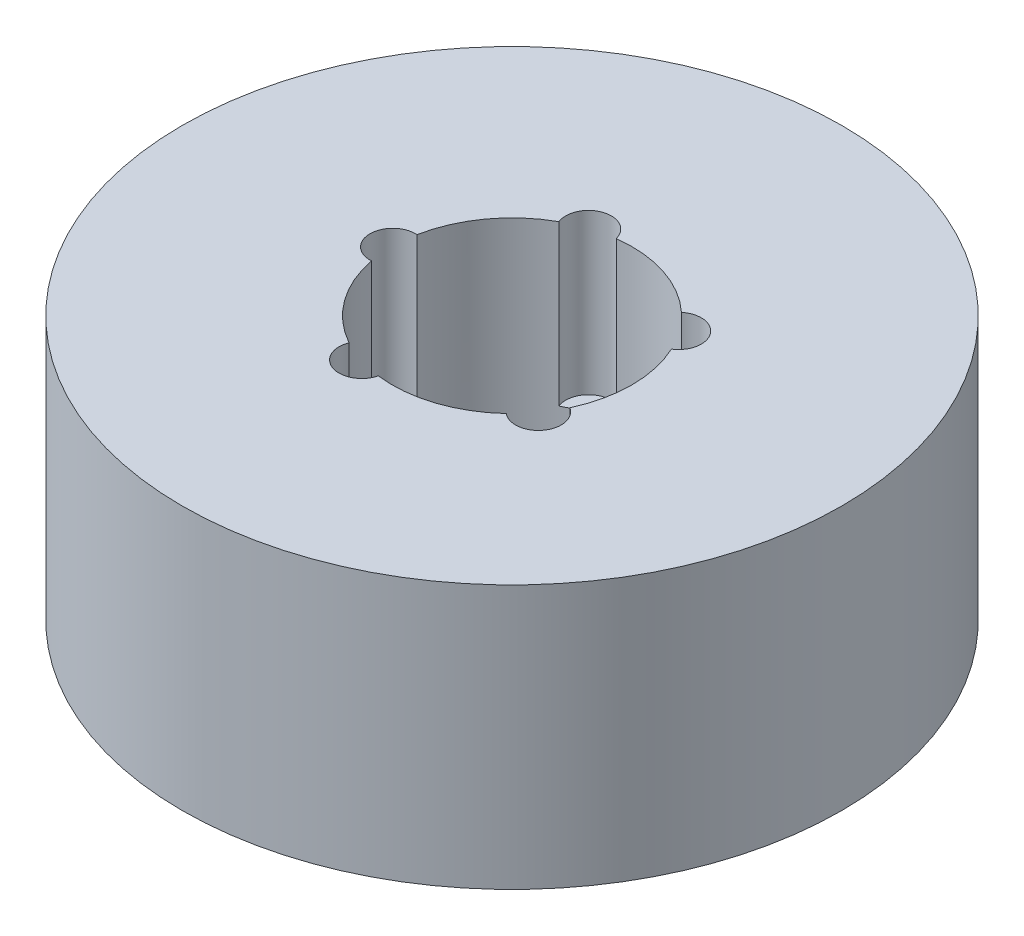
ISO-10303-21;
HEADER;
FILE_DESCRIPTION(('STEP AP214'),'2;1');
FILE_NAME('part.step','',(''),(''),'','','');
FILE_SCHEMA(('AUTOMOTIVE_DESIGN { 1 0 10303 214 1 1 1 1 }'));
ENDSEC;
DATA;
#1=APPLICATION_CONTEXT('core data for automotive mechanical design processes');
#2=APPLICATION_PROTOCOL_DEFINITION('international standard','automotive_design',2000,#1);
#3=PRODUCT_CONTEXT('',#1,'mechanical');
#4=PRODUCT('Part','Part','',(#3));
#5=PRODUCT_RELATED_PRODUCT_CATEGORY('part','',(#4));
#6=PRODUCT_DEFINITION_FORMATION('','',#4);
#7=PRODUCT_DEFINITION_CONTEXT('part definition',#1,'design');
#8=PRODUCT_DEFINITION('design','',#6,#7);
#9=PRODUCT_DEFINITION_SHAPE('','',#8);
#10=(LENGTH_UNIT() NAMED_UNIT(*) SI_UNIT(.MILLI.,.METRE.));
#11=(NAMED_UNIT(*) PLANE_ANGLE_UNIT() SI_UNIT($,.RADIAN.));
#12=(NAMED_UNIT(*) SI_UNIT($,.STERADIAN.) SOLID_ANGLE_UNIT());
#13=UNCERTAINTY_MEASURE_WITH_UNIT(LENGTH_MEASURE(1.E-05),#10,'distance_accuracy_value','');
#14=(GEOMETRIC_REPRESENTATION_CONTEXT(3) GLOBAL_UNCERTAINTY_ASSIGNED_CONTEXT((#13)) GLOBAL_UNIT_ASSIGNED_CONTEXT((#10,
#11,#12)) REPRESENTATION_CONTEXT('',''));
#15=CARTESIAN_POINT('',(0.,0.,0.));
#16=DIRECTION('',(0.,0.,1.));
#17=DIRECTION('',(1.,0.,0.));
#18=AXIS2_PLACEMENT_3D('',#15,#16,#17);
#19=CARTESIAN_POINT('',(0.,22.,0.));
#20=DIRECTION('',(0.,-1.,0.));
#21=DIRECTION('',(0.,0.,-1.));
#22=AXIS2_PLACEMENT_3D('',#19,#20,#21);
#23=CYLINDRICAL_SURFACE('',#22,27.5);
#24=CARTESIAN_POINT('',(0.,22.,0.));
#25=DIRECTION('',(0.,1.,0.));
#26=DIRECTION('',(0.,0.,1.));
#27=AXIS2_PLACEMENT_3D('',#24,#25,#26);
#28=CIRCLE('',#27,27.5);
#29=CARTESIAN_POINT('',(0.,22.,27.5));
#30=VERTEX_POINT('',#29);
#31=EDGE_CURVE('E157',#30,#30,#28,.T.);
#32=ORIENTED_EDGE('',*,*,#31,.F.);
#33=EDGE_LOOP('',(#32));
#34=FACE_BOUND('',#33,.T.);
#35=CARTESIAN_POINT('',(0.,0.,0.));
#36=DIRECTION('',(0.,1.,0.));
#37=DIRECTION('',(0.,0.,1.));
#38=AXIS2_PLACEMENT_3D('',#35,#36,#37);
#39=CIRCLE('',#38,27.5);
#40=CARTESIAN_POINT('',(0.,0.,27.5));
#41=VERTEX_POINT('',#40);
#42=EDGE_CURVE('E150',#41,#41,#39,.T.);
#43=ORIENTED_EDGE('',*,*,#42,.T.);
#44=EDGE_LOOP('',(#43));
#45=FACE_BOUND('',#44,.T.);
#46=ADVANCED_FACE('F39',(#34,#45),#23,.T.);
#47=CARTESIAN_POINT('',(0.,22.,0.));
#48=DIRECTION('',(0.,1.,0.));
#49=DIRECTION('',(0.,0.,1.));
#50=AXIS2_PLACEMENT_3D('',#47,#48,#49);
#51=PLANE('',#50);
#52=CARTESIAN_POINT('',(-3.07249362484301,22.,-9.45616304725487));
#53=DIRECTION('',(0.,1.,0.));
#54=DIRECTION('',(-0.95105651629515,0.,0.309016994374958));
#55=AXIS2_PLACEMENT_3D('',#52,#53,#54);
#56=CIRCLE('',#55,1.90239745731445);
#57=CARTESIAN_POINT('',(-1.22857995740503,22.,-9.92424260527032));
#58=VERTEX_POINT('',#57);
#59=CARTESIAN_POINT('',(-4.8393813790616,22.,-8.75102210418828));
#60=VERTEX_POINT('',#59);
#61=EDGE_CURVE('E194',#58,#60,#56,.T.);
#62=ORIENTED_EDGE('',*,*,#61,.F.);
#63=CARTESIAN_POINT('',(0.,22.,0.));
#64=DIRECTION('',(0.,1.,0.));
#65=DIRECTION('',(0.,0.,1.));
#66=AXIS2_PLACEMENT_3D('',#63,#64,#65);
#67=CIRCLE('',#66,10.);
#68=CARTESIAN_POINT('',(6.8272655080395,22.,-7.30673974373894));
#69=VERTEX_POINT('',#68);
#70=EDGE_CURVE('E147',#69,#58,#67,.T.);
#71=ORIENTED_EDGE('',*,*,#70,.F.);
#72=CARTESIAN_POINT('',(8.04389274005602,22.,-5.84423016636438));
#73=DIRECTION('',(0.,1.,0.));
#74=DIRECTION('',(-0.58778525229248,0.,-0.809016994374942));
#75=AXIS2_PLACEMENT_3D('',#72,#73,#74);
#76=CIRCLE('',#75,1.90239745731445);
#77=CARTESIAN_POINT('',(9.05886351324974,22.,-4.23520859560809));
#78=VERTEX_POINT('',#77);
#79=EDGE_CURVE('E254',#78,#69,#76,.T.);
#80=ORIENTED_EDGE('',*,*,#79,.F.);
#81=CARTESIAN_POINT('',(9.0588635132498,22.,4.23520859560796));
#82=VERTEX_POINT('',#81);
#83=EDGE_CURVE('E144',#82,#78,#67,.T.);
#84=ORIENTED_EDGE('',*,*,#83,.F.);
#85=CARTESIAN_POINT('',(8.04389274005611,22.,5.84423016636427));
#86=DIRECTION('',(0.,1.,0.));
#87=DIRECTION('',(0.587785252292469,0.,-0.809016994374951));
#88=AXIS2_PLACEMENT_3D('',#85,#86,#87);
#89=CIRCLE('',#88,1.90239745731445);
#90=CARTESIAN_POINT('',(6.8272655080396,22.,7.30673974373884));
#91=VERTEX_POINT('',#90);
#92=EDGE_CURVE('E141',#91,#82,#89,.T.);
#93=ORIENTED_EDGE('',*,*,#92,.F.);
#94=CARTESIAN_POINT('',(-1.22857995740489,22.,9.92424260527034));
#95=VERTEX_POINT('',#94);
#96=EDGE_CURVE('E134',#95,#91,#67,.T.);
#97=ORIENTED_EDGE('',*,*,#96,.F.);
#98=CARTESIAN_POINT('',(-3.07249362484287,22.,9.45616304725492));
#99=DIRECTION('',(0.,1.,0.));
#100=DIRECTION('',(0.951056516295155,0.,0.309016994374945));
#101=AXIS2_PLACEMENT_3D('',#98,#99,#100);
#102=CIRCLE('',#101,1.90239745731445);
#103=CARTESIAN_POINT('',(-4.83938137906148,22.,8.75102210418834));
#104=VERTEX_POINT('',#103);
#105=EDGE_CURVE('E111',#104,#95,#102,.T.);
#106=ORIENTED_EDGE('',*,*,#105,.F.);
#107=CARTESIAN_POINT('',(-9.81816768482291,22.,1.89831064704886));
#108=VERTEX_POINT('',#107);
#109=EDGE_CURVE('E145',#108,#104,#67,.T.);
#110=ORIENTED_EDGE('',*,*,#109,.F.);
#111=CARTESIAN_POINT('',(-9.94279823042636,22.,0.));
#112=DIRECTION('',(0.,1.,0.));
#113=DIRECTION('',(0.,0.,1.));
#114=AXIS2_PLACEMENT_3D('',#111,#112,#113);
#115=CIRCLE('',#114,1.90239745731445);
#116=CARTESIAN_POINT('',(-9.81816768482291,22.,-1.89831064704886));
#117=VERTEX_POINT('',#116);
#118=EDGE_CURVE('E153',#117,#108,#115,.T.);
#119=ORIENTED_EDGE('',*,*,#118,.F.);
#120=EDGE_CURVE('E146',#60,#117,#67,.T.);
#121=ORIENTED_EDGE('',*,*,#120,.F.);
#122=EDGE_LOOP('',(#62,#71,#80,#84,#93,#97,#106,#110,#119,#121));
#123=FACE_BOUND('',#122,.T.);
#124=ORIENTED_EDGE('',*,*,#31,.T.);
#125=EDGE_LOOP('',(#124));
#126=FACE_BOUND('',#125,.T.);
#127=ADVANCED_FACE('F139',(#123,#126),#51,.T.);
#128=CARTESIAN_POINT('',(0.,0.,0.));
#129=DIRECTION('',(0.,1.,0.));
#130=DIRECTION('',(0.,0.,1.));
#131=AXIS2_PLACEMENT_3D('',#128,#129,#130);
#132=PLANE('',#131);
#133=CARTESIAN_POINT('',(0.,0.,0.));
#134=DIRECTION('',(0.,1.,0.));
#135=DIRECTION('',(0.,0.,1.));
#136=AXIS2_PLACEMENT_3D('',#133,#134,#135);
#137=CIRCLE('',#136,10.);
#138=CARTESIAN_POINT('',(0.,0.,10.));
#139=VERTEX_POINT('',#138);
#140=EDGE_CURVE('E154',#139,#139,#137,.T.);
#141=ORIENTED_EDGE('',*,*,#140,.T.);
#142=EDGE_LOOP('',(#141));
#143=FACE_BOUND('',#142,.T.);
#144=ORIENTED_EDGE('',*,*,#42,.F.);
#145=EDGE_LOOP('',(#144));
#146=FACE_BOUND('',#145,.T.);
#147=ADVANCED_FACE('F213',(#143,#146),#132,.F.);
#148=CARTESIAN_POINT('',(0.,22.,0.));
#149=DIRECTION('',(0.,-1.,0.));
#150=DIRECTION('',(0.,0.,-1.));
#151=AXIS2_PLACEMENT_3D('',#148,#149,#150);
#152=CYLINDRICAL_SURFACE('',#151,10.);
#153=DIRECTION('',(0.,1.,0.));
#154=VECTOR('',#153,1.);
#155=CARTESIAN_POINT('',(-1.22857995740503,15.3415451495492,-9.92424260527032));
#156=LINE('',#155,#154);
#157=CARTESIAN_POINT('',(-1.22857995740503,8.68309029909848,-9.92424260527032));
#158=VERTEX_POINT('',#157);
#159=EDGE_CURVE('E11',#158,#58,#156,.T.);
#160=ORIENTED_EDGE('',*,*,#159,.F.);
#161=CARTESIAN_POINT('',(0.,8.68309029909848,0.));
#162=DIRECTION('',(0.,1.,0.));
#163=DIRECTION('',(0.,0.,1.));
#164=AXIS2_PLACEMENT_3D('',#161,#162,#163);
#165=CIRCLE('',#164,10.);
#166=CARTESIAN_POINT('',(-4.8393813790616,8.68309029909848,-8.75102210418828));
#167=VERTEX_POINT('',#166);
#168=EDGE_CURVE('E189',#158,#167,#165,.T.);
#169=ORIENTED_EDGE('',*,*,#168,.T.);
#170=DIRECTION('',(0.,1.,0.));
#171=VECTOR('',#170,1.);
#172=CARTESIAN_POINT('',(-4.8393813790616,15.3415451495492,-8.75102210418827));
#173=LINE('',#172,#171);
#174=EDGE_CURVE('E46',#60,#167,#173,.F.);
#175=ORIENTED_EDGE('',*,*,#174,.F.);
#176=ORIENTED_EDGE('',*,*,#120,.T.);
#177=DIRECTION('',(0.,1.,0.));
#178=VECTOR('',#177,1.);
#179=CARTESIAN_POINT('',(-9.81816768482291,15.3415451495492,-1.89831064704886));
#180=LINE('',#179,#178);
#181=CARTESIAN_POINT('',(-9.81816768482291,8.68309029909848,-1.89831064704886));
#182=VERTEX_POINT('',#181);
#183=EDGE_CURVE('E168',#182,#117,#180,.T.);
#184=ORIENTED_EDGE('',*,*,#183,.F.);
#185=CARTESIAN_POINT('',(0.,8.68309029909848,0.));
#186=DIRECTION('',(0.,1.,0.));
#187=DIRECTION('',(0.,0.,1.));
#188=AXIS2_PLACEMENT_3D('',#185,#186,#187);
#189=CIRCLE('',#188,10.);
#190=CARTESIAN_POINT('',(-9.81816768482291,8.68309029909848,1.89831064704886));
#191=VERTEX_POINT('',#190);
#192=EDGE_CURVE('E165',#182,#191,#189,.T.);
#193=ORIENTED_EDGE('',*,*,#192,.T.);
#194=DIRECTION('',(0.,1.,0.));
#195=VECTOR('',#194,1.);
#196=CARTESIAN_POINT('',(-9.81816768482291,15.3415451495492,1.89831064704886));
#197=LINE('',#196,#195);
#198=EDGE_CURVE('E170',#108,#191,#197,.F.);
#199=ORIENTED_EDGE('',*,*,#198,.F.);
#200=ORIENTED_EDGE('',*,*,#109,.T.);
#201=DIRECTION('',(0.,1.,0.));
#202=VECTOR('',#201,1.);
#203=CARTESIAN_POINT('',(-4.83938137906148,15.3415451495492,8.75102210418835));
#204=LINE('',#203,#202);
#205=CARTESIAN_POINT('',(-4.83938137906148,8.68309029909848,8.75102210418834));
#206=VERTEX_POINT('',#205);
#207=EDGE_CURVE('E121',#206,#104,#204,.T.);
#208=ORIENTED_EDGE('',*,*,#207,.F.);
#209=CARTESIAN_POINT('',(0.,8.68309029909848,0.));
#210=DIRECTION('',(0.,1.,0.));
#211=DIRECTION('',(0.,0.,1.));
#212=AXIS2_PLACEMENT_3D('',#209,#210,#211);
#213=CIRCLE('',#212,10.);
#214=CARTESIAN_POINT('',(-1.22857995740489,8.68309029909848,9.92424260527034));
#215=VERTEX_POINT('',#214);
#216=EDGE_CURVE('E136',#206,#215,#213,.T.);
#217=ORIENTED_EDGE('',*,*,#216,.T.);
#218=DIRECTION('',(0.,1.,0.));
#219=VECTOR('',#218,1.);
#220=CARTESIAN_POINT('',(-1.22857995740489,15.3415451495492,9.92424260527034));
#221=LINE('',#220,#219);
#222=EDGE_CURVE('E117',#95,#215,#221,.F.);
#223=ORIENTED_EDGE('',*,*,#222,.F.);
#224=ORIENTED_EDGE('',*,*,#96,.T.);
#225=DIRECTION('',(0.,1.,0.));
#226=VECTOR('',#225,1.);
#227=CARTESIAN_POINT('',(6.8272655080396,15.3415451495492,7.30673974373884));
#228=LINE('',#227,#226);
#229=CARTESIAN_POINT('',(6.8272655080396,8.68309029909848,7.30673974373884));
#230=VERTEX_POINT('',#229);
#231=EDGE_CURVE('E182',#230,#91,#228,.T.);
#232=ORIENTED_EDGE('',*,*,#231,.F.);
#233=CARTESIAN_POINT('',(0.,8.68309029909848,0.));
#234=DIRECTION('',(0.,1.,0.));
#235=DIRECTION('',(0.,0.,1.));
#236=AXIS2_PLACEMENT_3D('',#233,#234,#235);
#237=CIRCLE('',#236,10.);
#238=CARTESIAN_POINT('',(9.0588635132498,8.68309029909848,4.23520859560796));
#239=VERTEX_POINT('',#238);
#240=EDGE_CURVE('E174',#230,#239,#237,.T.);
#241=ORIENTED_EDGE('',*,*,#240,.T.);
#242=DIRECTION('',(0.,1.,0.));
#243=VECTOR('',#242,1.);
#244=CARTESIAN_POINT('',(9.0588635132498,15.3415451495492,4.23520859560796));
#245=LINE('',#244,#243);
#246=EDGE_CURVE('E177',#82,#239,#245,.F.);
#247=ORIENTED_EDGE('',*,*,#246,.F.);
#248=ORIENTED_EDGE('',*,*,#83,.T.);
#249=DIRECTION('',(0.,1.,0.));
#250=VECTOR('',#249,1.);
#251=CARTESIAN_POINT('',(9.05886351324974,15.3415451495492,-4.23520859560809));
#252=LINE('',#251,#250);
#253=CARTESIAN_POINT('',(9.05886351324974,8.68309029909848,-4.23520859560809));
#254=VERTEX_POINT('',#253);
#255=EDGE_CURVE('E187',#254,#78,#252,.T.);
#256=ORIENTED_EDGE('',*,*,#255,.F.);
#257=CARTESIAN_POINT('',(0.,8.68309029909848,0.));
#258=DIRECTION('',(0.,1.,0.));
#259=DIRECTION('',(0.,0.,1.));
#260=AXIS2_PLACEMENT_3D('',#257,#258,#259);
#261=CIRCLE('',#260,10.);
#262=CARTESIAN_POINT('',(6.8272655080395,8.68309029909848,-7.30673974373894));
#263=VERTEX_POINT('',#262);
#264=EDGE_CURVE('E181',#254,#263,#261,.T.);
#265=ORIENTED_EDGE('',*,*,#264,.T.);
#266=DIRECTION('',(0.,1.,0.));
#267=VECTOR('',#266,1.);
#268=CARTESIAN_POINT('',(6.8272655080395,15.3415451495492,-7.30673974373894));
#269=LINE('',#268,#267);
#270=EDGE_CURVE('E186',#69,#263,#269,.F.);
#271=ORIENTED_EDGE('',*,*,#270,.F.);
#272=ORIENTED_EDGE('',*,*,#70,.T.);
#273=EDGE_LOOP('',(#160,#169,#175,#176,#184,#193,#199,#200,#208,#217,#223,#224,#232,#241,#247,
#248,#256,#265,#271,#272));
#274=FACE_BOUND('',#273,.T.);
#275=ORIENTED_EDGE('',*,*,#140,.F.);
#276=EDGE_LOOP('',(#275));
#277=FACE_BOUND('',#276,.T.);
#278=ADVANCED_FACE('F135',(#274,#277),#152,.F.);
#279=CARTESIAN_POINT('',(-9.94279823042636,8.68309029909848,0.));
#280=DIRECTION('',(0.,1.,0.));
#281=DIRECTION('',(0.,0.,1.));
#282=AXIS2_PLACEMENT_3D('',#279,#280,#281);
#283=CYLINDRICAL_SURFACE('',#282,1.90239745731445);
#284=ORIENTED_EDGE('',*,*,#183,.T.);
#285=ORIENTED_EDGE('',*,*,#118,.T.);
#286=ORIENTED_EDGE('',*,*,#198,.T.);
#287=CARTESIAN_POINT('',(-9.94279823042636,8.68309029909848,0.));
#288=DIRECTION('',(0.,1.,0.));
#289=DIRECTION('',(0.,0.,1.));
#290=AXIS2_PLACEMENT_3D('',#287,#288,#289);
#291=CIRCLE('',#290,1.90239745731445);
#292=EDGE_CURVE('E158',#182,#191,#291,.T.);
#293=ORIENTED_EDGE('',*,*,#292,.F.);
#294=EDGE_LOOP('',(#284,#285,#286,#293));
#295=FACE_BOUND('',#294,.T.);
#296=ADVANCED_FACE('F221',(#295),#283,.F.);
#297=CARTESIAN_POINT('',(-9.94279823042636,8.68309029909848,0.));
#298=DIRECTION('',(0.,1.,0.));
#299=DIRECTION('',(0.,0.,1.));
#300=AXIS2_PLACEMENT_3D('',#297,#298,#299);
#301=PLANE('',#300);
#302=ORIENTED_EDGE('',*,*,#292,.T.);
#303=ORIENTED_EDGE('',*,*,#192,.F.);
#304=EDGE_LOOP('',(#302,#303));
#305=FACE_BOUND('',#304,.T.);
#306=ADVANCED_FACE('F227',(#305),#301,.T.);
#307=CARTESIAN_POINT('',(-3.07249362484287,8.68309029909848,9.45616304725492));
#308=DIRECTION('',(0.,1.,0.));
#309=DIRECTION('',(0.,0.,1.));
#310=AXIS2_PLACEMENT_3D('',#307,#308,#309);
#311=CYLINDRICAL_SURFACE('',#310,1.90239745731445);
#312=ORIENTED_EDGE('',*,*,#207,.T.);
#313=ORIENTED_EDGE('',*,*,#105,.T.);
#314=ORIENTED_EDGE('',*,*,#222,.T.);
#315=CARTESIAN_POINT('',(-3.07249362484287,8.68309029909848,9.45616304725492));
#316=DIRECTION('',(0.,1.,0.));
#317=DIRECTION('',(0.951056516295155,0.,0.309016994374945));
#318=AXIS2_PLACEMENT_3D('',#315,#316,#317);
#319=CIRCLE('',#318,1.90239745731445);
#320=EDGE_CURVE('E127',#206,#215,#319,.T.);
#321=ORIENTED_EDGE('',*,*,#320,.F.);
#322=EDGE_LOOP('',(#312,#313,#314,#321));
#323=FACE_BOUND('',#322,.T.);
#324=ADVANCED_FACE('F116',(#323),#311,.F.);
#325=CARTESIAN_POINT('',(-3.07249362484287,8.68309029909848,9.45616304725492));
#326=DIRECTION('',(0.,1.,0.));
#327=DIRECTION('',(0.951056516295155,0.,0.309016994374945));
#328=AXIS2_PLACEMENT_3D('',#325,#326,#327);
#329=PLANE('',#328);
#330=ORIENTED_EDGE('',*,*,#320,.T.);
#331=ORIENTED_EDGE('',*,*,#216,.F.);
#332=EDGE_LOOP('',(#330,#331));
#333=FACE_BOUND('',#332,.T.);
#334=ADVANCED_FACE('F234',(#333),#329,.T.);
#335=CARTESIAN_POINT('',(8.04389274005611,8.68309029909848,5.84423016636427));
#336=DIRECTION('',(0.,1.,0.));
#337=DIRECTION('',(0.,0.,1.));
#338=AXIS2_PLACEMENT_3D('',#335,#336,#337);
#339=CYLINDRICAL_SURFACE('',#338,1.90239745731445);
#340=ORIENTED_EDGE('',*,*,#231,.T.);
#341=ORIENTED_EDGE('',*,*,#92,.T.);
#342=ORIENTED_EDGE('',*,*,#246,.T.);
#343=CARTESIAN_POINT('',(8.04389274005611,8.68309029909848,5.84423016636427));
#344=DIRECTION('',(0.,1.,0.));
#345=DIRECTION('',(0.587785252292469,0.,-0.809016994374951));
#346=AXIS2_PLACEMENT_3D('',#343,#344,#345);
#347=CIRCLE('',#346,1.90239745731445);
#348=EDGE_CURVE('E130',#230,#239,#347,.T.);
#349=ORIENTED_EDGE('',*,*,#348,.F.);
#350=EDGE_LOOP('',(#340,#341,#342,#349));
#351=FACE_BOUND('',#350,.T.);
#352=ADVANCED_FACE('F240',(#351),#339,.F.);
#353=CARTESIAN_POINT('',(8.04389274005611,8.68309029909848,5.84423016636427));
#354=DIRECTION('',(0.,1.,0.));
#355=DIRECTION('',(0.587785252292469,0.,-0.809016994374951));
#356=AXIS2_PLACEMENT_3D('',#353,#354,#355);
#357=PLANE('',#356);
#358=ORIENTED_EDGE('',*,*,#348,.T.);
#359=ORIENTED_EDGE('',*,*,#240,.F.);
#360=EDGE_LOOP('',(#358,#359));
#361=FACE_BOUND('',#360,.T.);
#362=ADVANCED_FACE('F245',(#361),#357,.T.);
#363=CARTESIAN_POINT('',(8.04389274005602,8.68309029909848,-5.84423016636438));
#364=DIRECTION('',(0.,1.,0.));
#365=DIRECTION('',(0.,0.,1.));
#366=AXIS2_PLACEMENT_3D('',#363,#364,#365);
#367=CYLINDRICAL_SURFACE('',#366,1.90239745731445);
#368=ORIENTED_EDGE('',*,*,#255,.T.);
#369=ORIENTED_EDGE('',*,*,#79,.T.);
#370=ORIENTED_EDGE('',*,*,#270,.T.);
#371=CARTESIAN_POINT('',(8.04389274005602,8.68309029909848,-5.84423016636438));
#372=DIRECTION('',(0.,1.,0.));
#373=DIRECTION('',(-0.58778525229248,0.,-0.809016994374942));
#374=AXIS2_PLACEMENT_3D('',#371,#372,#373);
#375=CIRCLE('',#374,1.90239745731445);
#376=EDGE_CURVE('E56',#254,#263,#375,.T.);
#377=ORIENTED_EDGE('',*,*,#376,.F.);
#378=EDGE_LOOP('',(#368,#369,#370,#377));
#379=FACE_BOUND('',#378,.T.);
#380=ADVANCED_FACE('F266',(#379),#367,.F.);
#381=CARTESIAN_POINT('',(8.04389274005602,8.68309029909848,-5.84423016636438));
#382=DIRECTION('',(0.,1.,0.));
#383=DIRECTION('',(-0.58778525229248,0.,-0.809016994374942));
#384=AXIS2_PLACEMENT_3D('',#381,#382,#383);
#385=PLANE('',#384);
#386=ORIENTED_EDGE('',*,*,#376,.T.);
#387=ORIENTED_EDGE('',*,*,#264,.F.);
#388=EDGE_LOOP('',(#386,#387));
#389=FACE_BOUND('',#388,.T.);
#390=ADVANCED_FACE('F204',(#389),#385,.T.);
#391=CARTESIAN_POINT('',(-3.07249362484301,8.68309029909848,-9.45616304725487));
#392=DIRECTION('',(0.,1.,0.));
#393=DIRECTION('',(0.,0.,1.));
#394=AXIS2_PLACEMENT_3D('',#391,#392,#393);
#395=CYLINDRICAL_SURFACE('',#394,1.90239745731445);
#396=ORIENTED_EDGE('',*,*,#159,.T.);
#397=ORIENTED_EDGE('',*,*,#61,.T.);
#398=ORIENTED_EDGE('',*,*,#174,.T.);
#399=CARTESIAN_POINT('',(-3.07249362484301,8.68309029909848,-9.45616304725487));
#400=DIRECTION('',(0.,1.,0.));
#401=DIRECTION('',(-0.95105651629515,0.,0.309016994374958));
#402=AXIS2_PLACEMENT_3D('',#399,#400,#401);
#403=CIRCLE('',#402,1.90239745731445);
#404=EDGE_CURVE('E55',#158,#167,#403,.T.);
#405=ORIENTED_EDGE('',*,*,#404,.F.);
#406=EDGE_LOOP('',(#396,#397,#398,#405));
#407=FACE_BOUND('',#406,.T.);
#408=ADVANCED_FACE('F193',(#407),#395,.F.);
#409=CARTESIAN_POINT('',(-3.07249362484301,8.68309029909848,-9.45616304725487));
#410=DIRECTION('',(0.,1.,0.));
#411=DIRECTION('',(-0.95105651629515,0.,0.309016994374958));
#412=AXIS2_PLACEMENT_3D('',#409,#410,#411);
#413=PLANE('',#412);
#414=ORIENTED_EDGE('',*,*,#404,.T.);
#415=ORIENTED_EDGE('',*,*,#168,.F.);
#416=EDGE_LOOP('',(#414,#415));
#417=FACE_BOUND('',#416,.T.);
#418=ADVANCED_FACE('F196',(#417),#413,.T.);
#419=CLOSED_SHELL('',(#46,#127,#147,#278,#296,#306,#324,#334,#352,#362,#380,#390,#408,#418));
#420=MANIFOLD_SOLID_BREP('B2',#419);
#421=ADVANCED_BREP_SHAPE_REPRESENTATION('',(#18,#420),#14);
#422=SHAPE_DEFINITION_REPRESENTATION(#9,#421);
ENDSEC;
END-ISO-10303-21;
